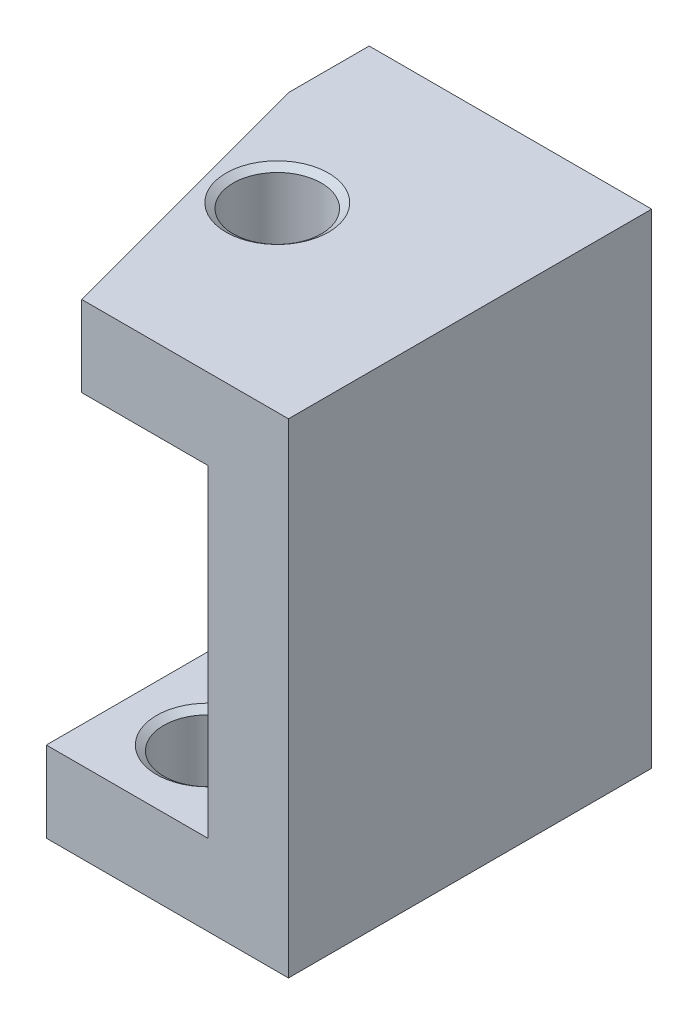
ISO-10303-21;
HEADER;
FILE_DESCRIPTION(('STEP AP214'),'2;1');
FILE_NAME('part.step','',(''),(''),'','','');
FILE_SCHEMA(('AUTOMOTIVE_DESIGN { 1 0 10303 214 1 1 1 1 }'));
ENDSEC;
DATA;
#1=APPLICATION_CONTEXT('core data for automotive mechanical design processes');
#2=APPLICATION_PROTOCOL_DEFINITION('international standard','automotive_design',2000,#1);
#3=PRODUCT_CONTEXT('',#1,'mechanical');
#4=PRODUCT('Part','Part','',(#3));
#5=PRODUCT_RELATED_PRODUCT_CATEGORY('part','',(#4));
#6=PRODUCT_DEFINITION_FORMATION('','',#4);
#7=PRODUCT_DEFINITION_CONTEXT('part definition',#1,'design');
#8=PRODUCT_DEFINITION('design','',#6,#7);
#9=PRODUCT_DEFINITION_SHAPE('','',#8);
#10=(LENGTH_UNIT() NAMED_UNIT(*) SI_UNIT(.MILLI.,.METRE.));
#11=(NAMED_UNIT(*) PLANE_ANGLE_UNIT() SI_UNIT($,.RADIAN.));
#12=(NAMED_UNIT(*) SI_UNIT($,.STERADIAN.) SOLID_ANGLE_UNIT());
#13=UNCERTAINTY_MEASURE_WITH_UNIT(LENGTH_MEASURE(1.E-05),#10,'distance_accuracy_value','');
#14=(GEOMETRIC_REPRESENTATION_CONTEXT(3) GLOBAL_UNCERTAINTY_ASSIGNED_CONTEXT((#13)) GLOBAL_UNIT_ASSIGNED_CONTEXT((#10,
#11,#12)) REPRESENTATION_CONTEXT('',''));
#15=CARTESIAN_POINT('',(0.,0.,0.));
#16=DIRECTION('',(0.,0.,1.));
#17=DIRECTION('',(1.,0.,0.));
#18=AXIS2_PLACEMENT_3D('',#15,#16,#17);
#19=CARTESIAN_POINT('',(0.,12.,9.));
#20=DIRECTION('',(0.,-1.,0.));
#21=DIRECTION('',(0.,0.,-1.));
#22=AXIS2_PLACEMENT_3D('',#19,#20,#21);
#23=PLANE('',#22);
#24=DIRECTION('',(0.,0.,1.));
#25=VECTOR('',#24,1.);
#26=CARTESIAN_POINT('',(18.,12.,0.));
#27=LINE('',#26,#25);
#28=CARTESIAN_POINT('',(18.,12.,0.));
#29=VERTEX_POINT('',#28);
#30=CARTESIAN_POINT('',(18.,12.,1.99999999999988));
#31=VERTEX_POINT('',#30);
#32=EDGE_CURVE('E131',#29,#31,#27,.T.);
#33=ORIENTED_EDGE('',*,*,#32,.T.);
#34=DIRECTION('',(0.258819045102518,0.,0.965925826289069));
#35=VECTOR('',#34,1.);
#36=CARTESIAN_POINT('',(19.8756443470179,12.,9.));
#37=LINE('',#36,#35);
#38=CARTESIAN_POINT('',(19.8756443470179,12.,9.));
#39=VERTEX_POINT('',#38);
#40=EDGE_CURVE('E11',#31,#39,#37,.T.);
#41=ORIENTED_EDGE('',*,*,#40,.T.);
#42=DIRECTION('',(-1.,0.,0.));
#43=VECTOR('',#42,1.);
#44=CARTESIAN_POINT('',(0.,12.,9.));
#45=LINE('',#44,#43);
#46=CARTESIAN_POINT('',(25.,12.,9.));
#47=VERTEX_POINT('',#46);
#48=EDGE_CURVE('E148',#47,#39,#45,.T.);
#49=ORIENTED_EDGE('',*,*,#48,.F.);
#50=DIRECTION('',(0.,0.,-1.));
#51=VECTOR('',#50,1.);
#52=CARTESIAN_POINT('',(25.,12.,9.));
#53=LINE('',#52,#51);
#54=CARTESIAN_POINT('',(25.,12.,0.));
#55=VERTEX_POINT('',#54);
#56=EDGE_CURVE('E151',#47,#55,#53,.T.);
#57=ORIENTED_EDGE('',*,*,#56,.T.);
#58=DIRECTION('',(-1.,0.,0.));
#59=VECTOR('',#58,1.);
#60=CARTESIAN_POINT('',(0.,12.,0.));
#61=LINE('',#60,#59);
#62=EDGE_CURVE('E146',#55,#29,#61,.T.);
#63=ORIENTED_EDGE('',*,*,#62,.T.);
#64=EDGE_LOOP('',(#33,#41,#49,#57,#63));
#65=FACE_BOUND('',#64,.T.);
#66=CARTESIAN_POINT('',(20.2227872516929,12.,4.5));
#67=DIRECTION('',(0.,1.,0.));
#68=DIRECTION('',(0.,0.,1.));
#69=AXIS2_PLACEMENT_3D('',#66,#67,#68);
#70=CIRCLE('',#69,1.27);
#71=CARTESIAN_POINT('',(20.2227872516929,12.,5.77));
#72=VERTEX_POINT('',#71);
#73=EDGE_CURVE('E214',#72,#72,#70,.T.);
#74=ORIENTED_EDGE('',*,*,#73,.F.);
#75=EDGE_LOOP('',(#74));
#76=FACE_BOUND('',#75,.T.);
#77=ADVANCED_FACE('F31',(#65,#76),#23,.F.);
#78=CARTESIAN_POINT('',(0.,0.,9.));
#79=DIRECTION('',(0.,1.,0.));
#80=DIRECTION('',(0.,0.,1.));
#81=AXIS2_PLACEMENT_3D('',#78,#79,#80);
#82=PLANE('',#81);
#83=DIRECTION('',(0.,0.,1.));
#84=VECTOR('',#83,1.);
#85=CARTESIAN_POINT('',(19.,0.,0.));
#86=LINE('',#85,#84);
#87=CARTESIAN_POINT('',(19.,0.,0.));
#88=VERTEX_POINT('',#87);
#89=CARTESIAN_POINT('',(19.,0.,9.));
#90=VERTEX_POINT('',#89);
#91=EDGE_CURVE('E127',#88,#90,#86,.T.);
#92=ORIENTED_EDGE('',*,*,#91,.F.);
#93=DIRECTION('',(1.,0.,0.));
#94=VECTOR('',#93,1.);
#95=CARTESIAN_POINT('',(0.,0.,0.));
#96=LINE('',#95,#94);
#97=CARTESIAN_POINT('',(25.,0.,0.));
#98=VERTEX_POINT('',#97);
#99=EDGE_CURVE('E120',#88,#98,#96,.T.);
#100=ORIENTED_EDGE('',*,*,#99,.T.);
#101=DIRECTION('',(0.,0.,-1.));
#102=VECTOR('',#101,1.);
#103=CARTESIAN_POINT('',(25.,0.,9.));
#104=LINE('',#103,#102);
#105=CARTESIAN_POINT('',(25.,0.,9.));
#106=VERTEX_POINT('',#105);
#107=EDGE_CURVE('E159',#106,#98,#104,.T.);
#108=ORIENTED_EDGE('',*,*,#107,.F.);
#109=DIRECTION('',(1.,0.,0.));
#110=VECTOR('',#109,1.);
#111=CARTESIAN_POINT('',(0.,0.,9.));
#112=LINE('',#111,#110);
#113=EDGE_CURVE('E143',#90,#106,#112,.T.);
#114=ORIENTED_EDGE('',*,*,#113,.F.);
#115=EDGE_LOOP('',(#92,#100,#108,#114));
#116=FACE_BOUND('',#115,.T.);
#117=CARTESIAN_POINT('',(21.,0.,7.));
#118=DIRECTION('',(0.,-1.,0.));
#119=DIRECTION('',(0.,0.,-1.));
#120=AXIS2_PLACEMENT_3D('',#117,#118,#119);
#121=CIRCLE('',#120,1.27);
#122=CARTESIAN_POINT('',(21.,0.,5.73));
#123=VERTEX_POINT('',#122);
#124=EDGE_CURVE('E190',#123,#123,#121,.T.);
#125=ORIENTED_EDGE('',*,*,#124,.F.);
#126=EDGE_LOOP('',(#125));
#127=FACE_BOUND('',#126,.T.);
#128=CARTESIAN_POINT('',(21.,0.,2.));
#129=DIRECTION('',(0.,-1.,0.));
#130=DIRECTION('',(0.,0.,-1.));
#131=AXIS2_PLACEMENT_3D('',#128,#129,#130);
#132=CIRCLE('',#131,1.27);
#133=CARTESIAN_POINT('',(21.,0.,0.73));
#134=VERTEX_POINT('',#133);
#135=EDGE_CURVE('E202',#134,#134,#132,.T.);
#136=ORIENTED_EDGE('',*,*,#135,.F.);
#137=EDGE_LOOP('',(#136));
#138=FACE_BOUND('',#137,.T.);
#139=ADVANCED_FACE('F242',(#116,#127,#138),#82,.F.);
#140=CARTESIAN_POINT('',(0.,12.,9.));
#141=DIRECTION('',(0.,0.,-1.));
#142=DIRECTION('',(-1.,0.,0.));
#143=AXIS2_PLACEMENT_3D('',#140,#141,#142);
#144=PLANE('',#143);
#145=ORIENTED_EDGE('',*,*,#48,.T.);
#146=DIRECTION('',(0.,-1.,0.));
#147=VECTOR('',#146,1.);
#148=CARTESIAN_POINT('',(19.8756443470179,10.,9.));
#149=LINE('',#148,#147);
#150=CARTESIAN_POINT('',(19.8756443470179,10.,9.));
#151=VERTEX_POINT('',#150);
#152=EDGE_CURVE('E162',#39,#151,#149,.T.);
#153=ORIENTED_EDGE('',*,*,#152,.T.);
#154=DIRECTION('',(-1.,0.,0.));
#155=VECTOR('',#154,1.);
#156=CARTESIAN_POINT('',(2.,10.,9.));
#157=LINE('',#156,#155);
#158=CARTESIAN_POINT('',(23.,10.,9.));
#159=VERTEX_POINT('',#158);
#160=EDGE_CURVE('E134',#159,#151,#157,.T.);
#161=ORIENTED_EDGE('',*,*,#160,.F.);
#162=DIRECTION('',(0.,1.,0.));
#163=VECTOR('',#162,1.);
#164=CARTESIAN_POINT('',(23.,2.,9.));
#165=LINE('',#164,#163);
#166=CARTESIAN_POINT('',(23.,2.,9.));
#167=VERTEX_POINT('',#166);
#168=EDGE_CURVE('E176',#167,#159,#165,.T.);
#169=ORIENTED_EDGE('',*,*,#168,.F.);
#170=DIRECTION('',(1.,0.,0.));
#171=VECTOR('',#170,1.);
#172=CARTESIAN_POINT('',(2.,2.,9.));
#173=LINE('',#172,#171);
#174=CARTESIAN_POINT('',(19.,2.,9.));
#175=VERTEX_POINT('',#174);
#176=EDGE_CURVE('E139',#175,#167,#173,.T.);
#177=ORIENTED_EDGE('',*,*,#176,.F.);
#178=DIRECTION('',(0.,-1.,0.));
#179=VECTOR('',#178,1.);
#180=CARTESIAN_POINT('',(19.,-15.7109600624776,9.));
#181=LINE('',#180,#179);
#182=EDGE_CURVE('E106',#175,#90,#181,.T.);
#183=ORIENTED_EDGE('',*,*,#182,.T.);
#184=ORIENTED_EDGE('',*,*,#113,.T.);
#185=DIRECTION('',(0.,1.,0.));
#186=VECTOR('',#185,1.);
#187=CARTESIAN_POINT('',(25.,0.,9.));
#188=LINE('',#187,#186);
#189=EDGE_CURVE('E145',#106,#47,#188,.T.);
#190=ORIENTED_EDGE('',*,*,#189,.T.);
#191=EDGE_LOOP('',(#145,#153,#161,#169,#177,#183,#184,#190));
#192=FACE_BOUND('',#191,.T.);
#193=ADVANCED_FACE('F168',(#192),#144,.F.);
#194=CARTESIAN_POINT('',(0.,12.,0.));
#195=DIRECTION('',(0.,0.,-1.));
#196=DIRECTION('',(-1.,0.,0.));
#197=AXIS2_PLACEMENT_3D('',#194,#195,#196);
#198=PLANE('',#197);
#199=ORIENTED_EDGE('',*,*,#99,.F.);
#200=DIRECTION('',(0.,-1.,0.));
#201=VECTOR('',#200,1.);
#202=CARTESIAN_POINT('',(19.,-15.7109600624776,0.));
#203=LINE('',#202,#201);
#204=CARTESIAN_POINT('',(19.,2.,0.));
#205=VERTEX_POINT('',#204);
#206=EDGE_CURVE('E103',#205,#88,#203,.T.);
#207=ORIENTED_EDGE('',*,*,#206,.F.);
#208=DIRECTION('',(1.,0.,0.));
#209=VECTOR('',#208,1.);
#210=CARTESIAN_POINT('',(2.,2.,0.));
#211=LINE('',#210,#209);
#212=CARTESIAN_POINT('',(23.,2.,0.));
#213=VERTEX_POINT('',#212);
#214=EDGE_CURVE('E117',#205,#213,#211,.T.);
#215=ORIENTED_EDGE('',*,*,#214,.T.);
#216=DIRECTION('',(0.,1.,0.));
#217=VECTOR('',#216,1.);
#218=CARTESIAN_POINT('',(23.,2.,0.));
#219=LINE('',#218,#217);
#220=CARTESIAN_POINT('',(23.,10.,0.));
#221=VERTEX_POINT('',#220);
#222=EDGE_CURVE('E126',#213,#221,#219,.T.);
#223=ORIENTED_EDGE('',*,*,#222,.T.);
#224=DIRECTION('',(-1.,0.,0.));
#225=VECTOR('',#224,1.);
#226=CARTESIAN_POINT('',(2.,10.,0.));
#227=LINE('',#226,#225);
#228=CARTESIAN_POINT('',(18.,10.,0.));
#229=VERTEX_POINT('',#228);
#230=EDGE_CURVE('E129',#221,#229,#227,.T.);
#231=ORIENTED_EDGE('',*,*,#230,.T.);
#232=DIRECTION('',(0.,-1.,0.));
#233=VECTOR('',#232,1.);
#234=CARTESIAN_POINT('',(18.,-15.7109600624776,0.));
#235=LINE('',#234,#233);
#236=EDGE_CURVE('E111',#29,#229,#235,.T.);
#237=ORIENTED_EDGE('',*,*,#236,.F.);
#238=ORIENTED_EDGE('',*,*,#62,.F.);
#239=DIRECTION('',(0.,1.,0.));
#240=VECTOR('',#239,1.);
#241=CARTESIAN_POINT('',(25.,0.,0.));
#242=LINE('',#241,#240);
#243=EDGE_CURVE('E153',#98,#55,#242,.T.);
#244=ORIENTED_EDGE('',*,*,#243,.F.);
#245=EDGE_LOOP('',(#199,#207,#215,#223,#231,#237,#238,#244));
#246=FACE_BOUND('',#245,.T.);
#247=ADVANCED_FACE('F115',(#246),#198,.T.);
#248=CARTESIAN_POINT('',(2.,2.,9.));
#249=DIRECTION('',(0.,1.,0.));
#250=DIRECTION('',(0.,0.,1.));
#251=AXIS2_PLACEMENT_3D('',#248,#249,#250);
#252=PLANE('',#251);
#253=CARTESIAN_POINT('',(21.,2.,2.));
#254=DIRECTION('',(0.,-1.,0.));
#255=DIRECTION('',(0.,0.,-1.));
#256=AXIS2_PLACEMENT_3D('',#253,#254,#255);
#257=CIRCLE('',#256,1.27);
#258=CARTESIAN_POINT('',(21.,2.,0.73));
#259=VERTEX_POINT('',#258);
#260=EDGE_CURVE('E205',#259,#259,#257,.T.);
#261=ORIENTED_EDGE('',*,*,#260,.T.);
#262=EDGE_LOOP('',(#261));
#263=FACE_BOUND('',#262,.T.);
#264=CARTESIAN_POINT('',(21.,2.,7.));
#265=DIRECTION('',(0.,-1.,0.));
#266=DIRECTION('',(0.,0.,-1.));
#267=AXIS2_PLACEMENT_3D('',#264,#265,#266);
#268=CIRCLE('',#267,1.27);
#269=CARTESIAN_POINT('',(21.,2.,5.73));
#270=VERTEX_POINT('',#269);
#271=EDGE_CURVE('E193',#270,#270,#268,.T.);
#272=ORIENTED_EDGE('',*,*,#271,.T.);
#273=EDGE_LOOP('',(#272));
#274=FACE_BOUND('',#273,.T.);
#275=ORIENTED_EDGE('',*,*,#214,.F.);
#276=DIRECTION('',(0.,0.,1.));
#277=VECTOR('',#276,1.);
#278=CARTESIAN_POINT('',(19.,2.,0.));
#279=LINE('',#278,#277);
#280=EDGE_CURVE('E100',#205,#175,#279,.T.);
#281=ORIENTED_EDGE('',*,*,#280,.T.);
#282=ORIENTED_EDGE('',*,*,#176,.T.);
#283=DIRECTION('',(0.,0.,-1.));
#284=VECTOR('',#283,1.);
#285=CARTESIAN_POINT('',(23.,2.,9.));
#286=LINE('',#285,#284);
#287=EDGE_CURVE('E124',#167,#213,#286,.T.);
#288=ORIENTED_EDGE('',*,*,#287,.T.);
#289=EDGE_LOOP('',(#275,#281,#282,#288));
#290=FACE_BOUND('',#289,.T.);
#291=ADVANCED_FACE('F122',(#263,#274,#290),#252,.T.);
#292=CARTESIAN_POINT('',(2.,10.,9.));
#293=DIRECTION('',(0.,-1.,0.));
#294=DIRECTION('',(0.,0.,-1.));
#295=AXIS2_PLACEMENT_3D('',#292,#293,#294);
#296=PLANE('',#295);
#297=CARTESIAN_POINT('',(20.2227872516929,10.,4.5));
#298=DIRECTION('',(0.,1.,0.));
#299=DIRECTION('',(0.,0.,1.));
#300=AXIS2_PLACEMENT_3D('',#297,#298,#299);
#301=CIRCLE('',#300,1.27);
#302=CARTESIAN_POINT('',(20.2227872516929,10.,5.77));
#303=VERTEX_POINT('',#302);
#304=EDGE_CURVE('E217',#303,#303,#301,.T.);
#305=ORIENTED_EDGE('',*,*,#304,.T.);
#306=EDGE_LOOP('',(#305));
#307=FACE_BOUND('',#306,.T.);
#308=ORIENTED_EDGE('',*,*,#160,.T.);
#309=DIRECTION('',(-0.258819045102518,0.,-0.965925826289069));
#310=VECTOR('',#309,1.);
#311=CARTESIAN_POINT('',(18.6782032302755,10.,4.53108891324557));
#312=LINE('',#311,#310);
#313=CARTESIAN_POINT('',(18.,10.,1.99999999999991));
#314=VERTEX_POINT('',#313);
#315=EDGE_CURVE('E53',#151,#314,#312,.T.);
#316=ORIENTED_EDGE('',*,*,#315,.T.);
#317=DIRECTION('',(0.,0.,1.));
#318=VECTOR('',#317,1.);
#319=CARTESIAN_POINT('',(18.,10.,0.));
#320=LINE('',#319,#318);
#321=EDGE_CURVE('E110',#229,#314,#320,.T.);
#322=ORIENTED_EDGE('',*,*,#321,.F.);
#323=ORIENTED_EDGE('',*,*,#230,.F.);
#324=DIRECTION('',(0.,0.,-1.));
#325=VECTOR('',#324,1.);
#326=CARTESIAN_POINT('',(23.,10.,9.));
#327=LINE('',#326,#325);
#328=EDGE_CURVE('E140',#159,#221,#327,.T.);
#329=ORIENTED_EDGE('',*,*,#328,.F.);
#330=EDGE_LOOP('',(#308,#316,#322,#323,#329));
#331=FACE_BOUND('',#330,.T.);
#332=ADVANCED_FACE('F173',(#307,#331),#296,.T.);
#333=CARTESIAN_POINT('',(25.,0.,9.));
#334=DIRECTION('',(-1.,0.,0.));
#335=DIRECTION('',(0.,0.,1.));
#336=AXIS2_PLACEMENT_3D('',#333,#334,#335);
#337=PLANE('',#336);
#338=ORIENTED_EDGE('',*,*,#243,.T.);
#339=ORIENTED_EDGE('',*,*,#56,.F.);
#340=ORIENTED_EDGE('',*,*,#189,.F.);
#341=ORIENTED_EDGE('',*,*,#107,.T.);
#342=EDGE_LOOP('',(#338,#339,#340,#341));
#343=FACE_BOUND('',#342,.T.);
#344=ADVANCED_FACE('F252',(#343),#337,.F.);
#345=CARTESIAN_POINT('',(23.,2.,9.));
#346=DIRECTION('',(-1.,0.,0.));
#347=DIRECTION('',(0.,0.,1.));
#348=AXIS2_PLACEMENT_3D('',#345,#346,#347);
#349=PLANE('',#348);
#350=ORIENTED_EDGE('',*,*,#222,.F.);
#351=ORIENTED_EDGE('',*,*,#287,.F.);
#352=ORIENTED_EDGE('',*,*,#168,.T.);
#353=ORIENTED_EDGE('',*,*,#328,.T.);
#354=EDGE_LOOP('',(#350,#351,#352,#353));
#355=FACE_BOUND('',#354,.T.);
#356=ADVANCED_FACE('F254',(#355),#349,.T.);
#357=CARTESIAN_POINT('',(18.,-15.7109600624776,0.));
#358=DIRECTION('',(-1.,0.,0.));
#359=DIRECTION('',(0.,0.,1.));
#360=AXIS2_PLACEMENT_3D('',#357,#358,#359);
#361=PLANE('',#360);
#362=ORIENTED_EDGE('',*,*,#321,.T.);
#363=DIRECTION('',(0.,1.,0.));
#364=VECTOR('',#363,1.);
#365=CARTESIAN_POINT('',(18.,12.,1.99999999999991));
#366=LINE('',#365,#364);
#367=EDGE_CURVE('E39',#314,#31,#366,.T.);
#368=ORIENTED_EDGE('',*,*,#367,.T.);
#369=ORIENTED_EDGE('',*,*,#32,.F.);
#370=ORIENTED_EDGE('',*,*,#236,.T.);
#371=EDGE_LOOP('',(#362,#368,#369,#370));
#372=FACE_BOUND('',#371,.T.);
#373=ADVANCED_FACE('F260',(#372),#361,.T.);
#374=CARTESIAN_POINT('',(19.,-15.7109600624776,0.));
#375=DIRECTION('',(-1.,0.,0.));
#376=DIRECTION('',(0.,0.,1.));
#377=AXIS2_PLACEMENT_3D('',#374,#375,#376);
#378=PLANE('',#377);
#379=ORIENTED_EDGE('',*,*,#182,.F.);
#380=ORIENTED_EDGE('',*,*,#280,.F.);
#381=ORIENTED_EDGE('',*,*,#206,.T.);
#382=ORIENTED_EDGE('',*,*,#91,.T.);
#383=EDGE_LOOP('',(#379,#380,#381,#382));
#384=FACE_BOUND('',#383,.T.);
#385=ADVANCED_FACE('F102',(#384),#378,.T.);
#386=CARTESIAN_POINT('',(19.8756443470179,12.,9.));
#387=DIRECTION('',(-0.965925826289069,0.,0.258819045102518));
#388=DIRECTION('',(0.258819045102518,0.,0.965925826289069));
#389=AXIS2_PLACEMENT_3D('',#386,#387,#388);
#390=PLANE('',#389);
#391=ORIENTED_EDGE('',*,*,#40,.F.);
#392=ORIENTED_EDGE('',*,*,#367,.F.);
#393=ORIENTED_EDGE('',*,*,#315,.F.);
#394=ORIENTED_EDGE('',*,*,#152,.F.);
#395=EDGE_LOOP('',(#391,#392,#393,#394));
#396=FACE_BOUND('',#395,.T.);
#397=ADVANCED_FACE('F33',(#396),#390,.T.);
#398=CARTESIAN_POINT('',(21.,1.87550309970631,7.));
#399=DIRECTION('',(0.,1.,0.));
#400=DIRECTION('',(0.,0.,1.));
#401=AXIS2_PLACEMENT_3D('',#398,#399,#400);
#402=CONICAL_SURFACE('',#401,1.0922,0.959931088596884);
#403=ORIENTED_EDGE('',*,*,#271,.F.);
#404=EDGE_LOOP('',(#403));
#405=FACE_BOUND('',#404,.T.);
#406=CARTESIAN_POINT('',(21.,1.87550309970631,7.));
#407=DIRECTION('',(0.,-1.,0.));
#408=DIRECTION('',(0.,0.,-1.));
#409=AXIS2_PLACEMENT_3D('',#406,#407,#408);
#410=CIRCLE('',#409,1.0922);
#411=CARTESIAN_POINT('',(21.,1.87550309970631,5.9078));
#412=VERTEX_POINT('',#411);
#413=EDGE_CURVE('E183',#412,#412,#410,.T.);
#414=ORIENTED_EDGE('',*,*,#413,.T.);
#415=EDGE_LOOP('',(#414));
#416=FACE_BOUND('',#415,.T.);
#417=ADVANCED_FACE('F296',(#405,#416),#402,.F.);
#418=CARTESIAN_POINT('',(21.,0.,7.));
#419=DIRECTION('',(0.,-1.,0.));
#420=DIRECTION('',(0.,0.,-1.));
#421=AXIS2_PLACEMENT_3D('',#418,#419,#420);
#422=CYLINDRICAL_SURFACE('',#421,1.0922);
#423=ORIENTED_EDGE('',*,*,#413,.F.);
#424=EDGE_LOOP('',(#423));
#425=FACE_BOUND('',#424,.T.);
#426=CARTESIAN_POINT('',(21.,0.124496900293687,7.));
#427=DIRECTION('',(0.,-1.,0.));
#428=DIRECTION('',(0.,0.,-1.));
#429=AXIS2_PLACEMENT_3D('',#426,#427,#428);
#430=CIRCLE('',#429,1.0922);
#431=CARTESIAN_POINT('',(21.,0.124496900293687,5.9078));
#432=VERTEX_POINT('',#431);
#433=EDGE_CURVE('E187',#432,#432,#430,.T.);
#434=ORIENTED_EDGE('',*,*,#433,.T.);
#435=EDGE_LOOP('',(#434));
#436=FACE_BOUND('',#435,.T.);
#437=ADVANCED_FACE('F292',(#425,#436),#422,.F.);
#438=CARTESIAN_POINT('',(21.,0.,7.));
#439=DIRECTION('',(0.,-1.,0.));
#440=DIRECTION('',(0.,0.,-1.));
#441=AXIS2_PLACEMENT_3D('',#438,#439,#440);
#442=CONICAL_SURFACE('',#441,1.27,0.959931088596887);
#443=ORIENTED_EDGE('',*,*,#433,.F.);
#444=EDGE_LOOP('',(#443));
#445=FACE_BOUND('',#444,.T.);
#446=ORIENTED_EDGE('',*,*,#124,.T.);
#447=EDGE_LOOP('',(#446));
#448=FACE_BOUND('',#447,.T.);
#449=ADVANCED_FACE('F288',(#445,#448),#442,.F.);
#450=CARTESIAN_POINT('',(21.,1.87550309970631,2.));
#451=DIRECTION('',(0.,1.,0.));
#452=DIRECTION('',(0.,0.,1.));
#453=AXIS2_PLACEMENT_3D('',#450,#451,#452);
#454=CONICAL_SURFACE('',#453,1.0922,0.959931088596884);
#455=ORIENTED_EDGE('',*,*,#260,.F.);
#456=EDGE_LOOP('',(#455));
#457=FACE_BOUND('',#456,.T.);
#458=CARTESIAN_POINT('',(21.,1.87550309970631,2.));
#459=DIRECTION('',(0.,-1.,0.));
#460=DIRECTION('',(0.,0.,-1.));
#461=AXIS2_PLACEMENT_3D('',#458,#459,#460);
#462=CIRCLE('',#461,1.0922);
#463=CARTESIAN_POINT('',(21.,1.87550309970631,0.907800000000002));
#464=VERTEX_POINT('',#463);
#465=EDGE_CURVE('E196',#464,#464,#462,.T.);
#466=ORIENTED_EDGE('',*,*,#465,.T.);
#467=EDGE_LOOP('',(#466));
#468=FACE_BOUND('',#467,.T.);
#469=ADVANCED_FACE('F281',(#457,#468),#454,.F.);
#470=CARTESIAN_POINT('',(21.,0.,2.));
#471=DIRECTION('',(0.,-1.,0.));
#472=DIRECTION('',(0.,0.,-1.));
#473=AXIS2_PLACEMENT_3D('',#470,#471,#472);
#474=CYLINDRICAL_SURFACE('',#473,1.0922);
#475=ORIENTED_EDGE('',*,*,#465,.F.);
#476=EDGE_LOOP('',(#475));
#477=FACE_BOUND('',#476,.T.);
#478=CARTESIAN_POINT('',(21.,0.124496900293687,2.));
#479=DIRECTION('',(0.,-1.,0.));
#480=DIRECTION('',(0.,0.,-1.));
#481=AXIS2_PLACEMENT_3D('',#478,#479,#480);
#482=CIRCLE('',#481,1.0922);
#483=CARTESIAN_POINT('',(21.,0.124496900293687,0.907800000000002));
#484=VERTEX_POINT('',#483);
#485=EDGE_CURVE('E199',#484,#484,#482,.T.);
#486=ORIENTED_EDGE('',*,*,#485,.T.);
#487=EDGE_LOOP('',(#486));
#488=FACE_BOUND('',#487,.T.);
#489=ADVANCED_FACE('F275',(#477,#488),#474,.F.);
#490=CARTESIAN_POINT('',(21.,0.,2.));
#491=DIRECTION('',(0.,-1.,0.));
#492=DIRECTION('',(0.,0.,-1.));
#493=AXIS2_PLACEMENT_3D('',#490,#491,#492);
#494=CONICAL_SURFACE('',#493,1.27,0.959931088596887);
#495=ORIENTED_EDGE('',*,*,#485,.F.);
#496=EDGE_LOOP('',(#495));
#497=FACE_BOUND('',#496,.T.);
#498=ORIENTED_EDGE('',*,*,#135,.T.);
#499=EDGE_LOOP('',(#498));
#500=FACE_BOUND('',#499,.T.);
#501=ADVANCED_FACE('F226',(#497,#500),#494,.F.);
#502=CARTESIAN_POINT('',(20.2227872516929,10.1244969002937,4.5));
#503=DIRECTION('',(0.,-1.,0.));
#504=DIRECTION('',(0.,0.,-1.));
#505=AXIS2_PLACEMENT_3D('',#502,#503,#504);
#506=CONICAL_SURFACE('',#505,1.0922,0.959931088596886);
#507=ORIENTED_EDGE('',*,*,#304,.F.);
#508=EDGE_LOOP('',(#507));
#509=FACE_BOUND('',#508,.T.);
#510=CARTESIAN_POINT('',(20.2227872516929,10.1244969002937,4.5));
#511=DIRECTION('',(0.,1.,0.));
#512=DIRECTION('',(0.,0.,1.));
#513=AXIS2_PLACEMENT_3D('',#510,#511,#512);
#514=CIRCLE('',#513,1.0922);
#515=CARTESIAN_POINT('',(20.2227872516929,10.1244969002937,5.5922));
#516=VERTEX_POINT('',#515);
#517=EDGE_CURVE('E208',#516,#516,#514,.T.);
#518=ORIENTED_EDGE('',*,*,#517,.T.);
#519=EDGE_LOOP('',(#518));
#520=FACE_BOUND('',#519,.T.);
#521=ADVANCED_FACE('F222',(#509,#520),#506,.F.);
#522=CARTESIAN_POINT('',(20.2227872516929,12.,4.5));
#523=DIRECTION('',(0.,1.,0.));
#524=DIRECTION('',(0.,0.,1.));
#525=AXIS2_PLACEMENT_3D('',#522,#523,#524);
#526=CYLINDRICAL_SURFACE('',#525,1.09219999999999);
#527=ORIENTED_EDGE('',*,*,#517,.F.);
#528=EDGE_LOOP('',(#527));
#529=FACE_BOUND('',#528,.T.);
#530=CARTESIAN_POINT('',(20.2227872516929,11.8755030997063,4.5));
#531=DIRECTION('',(0.,1.,0.));
#532=DIRECTION('',(0.,0.,1.));
#533=AXIS2_PLACEMENT_3D('',#530,#531,#532);
#534=CIRCLE('',#533,1.09219999999999);
#535=CARTESIAN_POINT('',(20.2227872516929,11.8755030997063,5.59219999999999));
#536=VERTEX_POINT('',#535);
#537=EDGE_CURVE('E211',#536,#536,#534,.T.);
#538=ORIENTED_EDGE('',*,*,#537,.T.);
#539=EDGE_LOOP('',(#538));
#540=FACE_BOUND('',#539,.T.);
#541=ADVANCED_FACE('F225',(#529,#540),#526,.F.);
#542=CARTESIAN_POINT('',(20.2227872516929,12.,4.5));
#543=DIRECTION('',(0.,1.,0.));
#544=DIRECTION('',(0.,0.,1.));
#545=AXIS2_PLACEMENT_3D('',#542,#543,#544);
#546=CONICAL_SURFACE('',#545,1.27,0.959931088596953);
#547=ORIENTED_EDGE('',*,*,#537,.F.);
#548=EDGE_LOOP('',(#547));
#549=FACE_BOUND('',#548,.T.);
#550=ORIENTED_EDGE('',*,*,#73,.T.);
#551=EDGE_LOOP('',(#550));
#552=FACE_BOUND('',#551,.T.);
#553=ADVANCED_FACE('F232',(#549,#552),#546,.F.);
#554=CLOSED_SHELL('',(#77,#139,#193,#247,#291,#332,#344,#356,#373,#385,#397,#417,#437,#449,#469,
#489,#501,#521,#541,#553));
#555=MANIFOLD_SOLID_BREP('B2',#554);
#556=ADVANCED_BREP_SHAPE_REPRESENTATION('',(#18,#555),#14);
#557=SHAPE_DEFINITION_REPRESENTATION(#9,#556);
ENDSEC;
END-ISO-10303-21;
